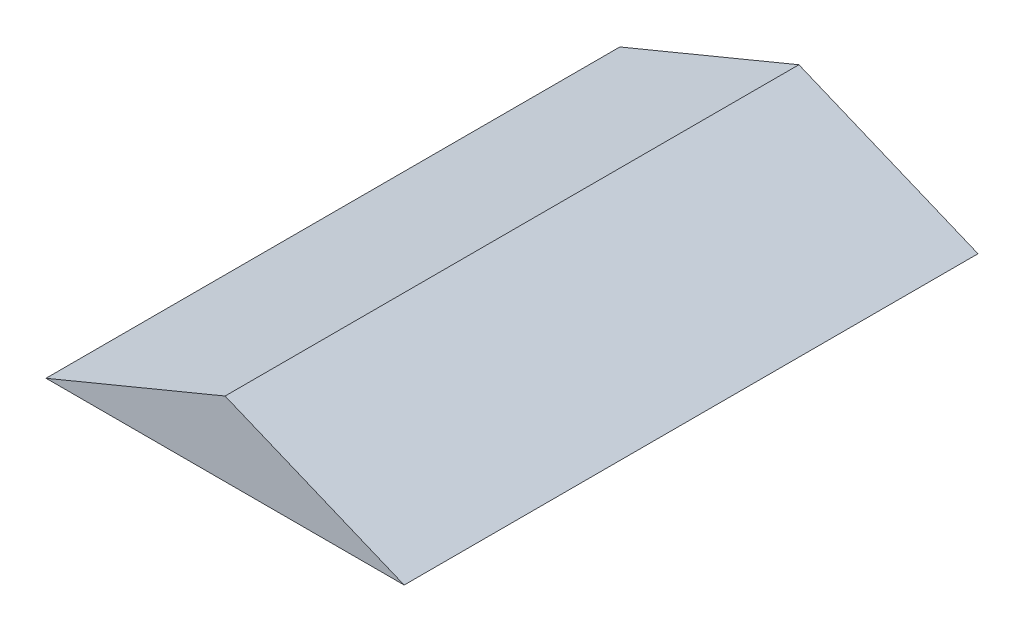
ISO-10303-21;
HEADER;
FILE_DESCRIPTION(('STEP AP214'),'2;1');
FILE_NAME('part.step','',(''),(''),'','','');
FILE_SCHEMA(('AUTOMOTIVE_DESIGN { 1 0 10303 214 1 1 1 1 }'));
ENDSEC;
DATA;
#1=APPLICATION_CONTEXT('core data for automotive mechanical design processes');
#2=APPLICATION_PROTOCOL_DEFINITION('international standard','automotive_design',2000,#1);
#3=PRODUCT_CONTEXT('',#1,'mechanical');
#4=PRODUCT('Part','Part','',(#3));
#5=PRODUCT_RELATED_PRODUCT_CATEGORY('part','',(#4));
#6=PRODUCT_DEFINITION_FORMATION('','',#4);
#7=PRODUCT_DEFINITION_CONTEXT('part definition',#1,'design');
#8=PRODUCT_DEFINITION('design','',#6,#7);
#9=PRODUCT_DEFINITION_SHAPE('','',#8);
#10=(LENGTH_UNIT() NAMED_UNIT(*) SI_UNIT(.MILLI.,.METRE.));
#11=(NAMED_UNIT(*) PLANE_ANGLE_UNIT() SI_UNIT($,.RADIAN.));
#12=(NAMED_UNIT(*) SI_UNIT($,.STERADIAN.) SOLID_ANGLE_UNIT());
#13=UNCERTAINTY_MEASURE_WITH_UNIT(LENGTH_MEASURE(1.E-05),#10,'distance_accuracy_value','');
#14=(GEOMETRIC_REPRESENTATION_CONTEXT(3) GLOBAL_UNCERTAINTY_ASSIGNED_CONTEXT((#13)) GLOBAL_UNIT_ASSIGNED_CONTEXT((#10,
#11,#12)) REPRESENTATION_CONTEXT('',''));
#15=CARTESIAN_POINT('',(0.,0.,0.));
#16=DIRECTION('',(0.,0.,1.));
#17=DIRECTION('',(1.,0.,0.));
#18=AXIS2_PLACEMENT_3D('',#15,#16,#17);
#19=CARTESIAN_POINT('',(-0.362306503281888,-7.26440259892909,80.1));
#20=DIRECTION('',(0.382526121671268,-0.923944677044648,0.));
#21=DIRECTION('',(0.923944677044648,0.382526121671268,0.));
#22=AXIS2_PLACEMENT_3D('',#19,#20,#21);
#23=PLANE('',#22);
#24=DIRECTION('',(-0.923944677044648,-0.382526121671268,0.));
#25=VECTOR('',#24,1.);
#26=CARTESIAN_POINT('',(-0.362306503281888,-7.26440259892909,0.));
#27=LINE('',#26,#25);
#28=CARTESIAN_POINT('',(-0.362306503281888,-7.26440259892909,0.));
#29=VERTEX_POINT('',#28);
#30=CARTESIAN_POINT('',(-25.3614552297318,-17.6144025989291,0.));
#31=VERTEX_POINT('',#30);
#32=EDGE_CURVE('E89',#29,#31,#27,.T.);
#33=ORIENTED_EDGE('',*,*,#32,.T.);
#34=DIRECTION('',(0.,0.,-1.));
#35=VECTOR('',#34,1.);
#36=CARTESIAN_POINT('',(-25.3614552297318,-17.6144025989291,80.1));
#37=LINE('',#36,#35);
#38=CARTESIAN_POINT('',(-25.3614552297318,-17.6144025989291,80.1));
#39=VERTEX_POINT('',#38);
#40=EDGE_CURVE('E11',#39,#31,#37,.T.);
#41=ORIENTED_EDGE('',*,*,#40,.F.);
#42=DIRECTION('',(-0.923944677044648,-0.382526121671268,0.));
#43=VECTOR('',#42,1.);
#44=CARTESIAN_POINT('',(-0.362306503281888,-7.26440259892909,80.1));
#45=LINE('',#44,#43);
#46=CARTESIAN_POINT('',(-0.362306503281888,-7.26440259892909,80.1));
#47=VERTEX_POINT('',#46);
#48=EDGE_CURVE('E81',#47,#39,#45,.T.);
#49=ORIENTED_EDGE('',*,*,#48,.F.);
#50=DIRECTION('',(0.,0.,-1.));
#51=VECTOR('',#50,1.);
#52=CARTESIAN_POINT('',(-0.362306503281888,-7.26440259892909,80.1));
#53=LINE('',#52,#51);
#54=EDGE_CURVE('E90',#47,#29,#53,.T.);
#55=ORIENTED_EDGE('',*,*,#54,.T.);
#56=EDGE_LOOP('',(#33,#41,#49,#55));
#57=FACE_BOUND('',#56,.T.);
#58=ADVANCED_FACE('F39',(#57),#23,.F.);
#59=CARTESIAN_POINT('',(-25.3614552297318,-17.6144025989291,80.1));
#60=DIRECTION('',(0.,1.,0.));
#61=DIRECTION('',(0.,0.,1.));
#62=AXIS2_PLACEMENT_3D('',#59,#60,#61);
#63=PLANE('',#62);
#64=DIRECTION('',(1.,0.,0.));
#65=VECTOR('',#64,1.);
#66=CARTESIAN_POINT('',(-25.3614552297318,-17.6144025989291,0.));
#67=LINE('',#66,#65);
#68=CARTESIAN_POINT('',(24.6385447702682,-17.6144025989291,0.));
#69=VERTEX_POINT('',#68);
#70=EDGE_CURVE('E68',#31,#69,#67,.T.);
#71=ORIENTED_EDGE('',*,*,#70,.T.);
#72=DIRECTION('',(0.,0.,-1.));
#73=VECTOR('',#72,1.);
#74=CARTESIAN_POINT('',(24.6385447702682,-17.6144025989291,80.1));
#75=LINE('',#74,#73);
#76=CARTESIAN_POINT('',(24.6385447702682,-17.6144025989291,80.1));
#77=VERTEX_POINT('',#76);
#78=EDGE_CURVE('E48',#77,#69,#75,.T.);
#79=ORIENTED_EDGE('',*,*,#78,.F.);
#80=DIRECTION('',(1.,0.,0.));
#81=VECTOR('',#80,1.);
#82=CARTESIAN_POINT('',(-25.3614552297318,-17.6144025989291,80.1));
#83=LINE('',#82,#81);
#84=EDGE_CURVE('E76',#39,#77,#83,.T.);
#85=ORIENTED_EDGE('',*,*,#84,.F.);
#86=ORIENTED_EDGE('',*,*,#40,.T.);
#87=EDGE_LOOP('',(#71,#79,#85,#86));
#88=FACE_BOUND('',#87,.T.);
#89=ADVANCED_FACE('F77',(#88),#63,.F.);
#90=CARTESIAN_POINT('',(24.6385447702682,-17.6144025989291,80.1));
#91=DIRECTION('',(-0.382503883254606,-0.923953883749155,0.));
#92=DIRECTION('',(0.923953883749155,-0.382503883254606,0.));
#93=AXIS2_PLACEMENT_3D('',#90,#91,#92);
#94=PLANE('',#93);
#95=DIRECTION('',(-0.923953883749155,0.382503883254606,0.));
#96=VECTOR('',#95,1.);
#97=CARTESIAN_POINT('',(24.6385447702682,-17.6144025989291,0.));
#98=LINE('',#97,#96);
#99=EDGE_CURVE('E73',#69,#29,#98,.T.);
#100=ORIENTED_EDGE('',*,*,#99,.T.);
#101=ORIENTED_EDGE('',*,*,#54,.F.);
#102=DIRECTION('',(-0.923953883749155,0.382503883254606,0.));
#103=VECTOR('',#102,1.);
#104=CARTESIAN_POINT('',(24.6385447702682,-17.6144025989291,80.1));
#105=LINE('',#104,#103);
#106=EDGE_CURVE('E56',#77,#47,#105,.T.);
#107=ORIENTED_EDGE('',*,*,#106,.F.);
#108=ORIENTED_EDGE('',*,*,#78,.T.);
#109=EDGE_LOOP('',(#100,#101,#107,#108));
#110=FACE_BOUND('',#109,.T.);
#111=ADVANCED_FACE('F102',(#110),#94,.F.);
#112=CARTESIAN_POINT('',(0.,0.,80.1));
#113=DIRECTION('',(0.,0.,-1.));
#114=DIRECTION('',(-1.,0.,0.));
#115=AXIS2_PLACEMENT_3D('',#112,#113,#114);
#116=PLANE('',#115);
#117=ORIENTED_EDGE('',*,*,#48,.T.);
#118=ORIENTED_EDGE('',*,*,#84,.T.);
#119=ORIENTED_EDGE('',*,*,#106,.T.);
#120=EDGE_LOOP('',(#117,#118,#119));
#121=FACE_BOUND('',#120,.T.);
#122=ADVANCED_FACE('F84',(#121),#116,.F.);
#123=CARTESIAN_POINT('',(0.,0.,0.));
#124=DIRECTION('',(0.,0.,-1.));
#125=DIRECTION('',(-1.,0.,0.));
#126=AXIS2_PLACEMENT_3D('',#123,#124,#125);
#127=PLANE('',#126);
#128=ORIENTED_EDGE('',*,*,#32,.F.);
#129=ORIENTED_EDGE('',*,*,#99,.F.);
#130=ORIENTED_EDGE('',*,*,#70,.F.);
#131=EDGE_LOOP('',(#128,#129,#130));
#132=FACE_BOUND('',#131,.T.);
#133=ADVANCED_FACE('F103',(#132),#127,.T.);
#134=CLOSED_SHELL('',(#58,#89,#111,#122,#133));
#135=MANIFOLD_SOLID_BREP('B2',#134);
#136=ADVANCED_BREP_SHAPE_REPRESENTATION('',(#18,#135),#14);
#137=SHAPE_DEFINITION_REPRESENTATION(#9,#136);
ENDSEC;
END-ISO-10303-21;
